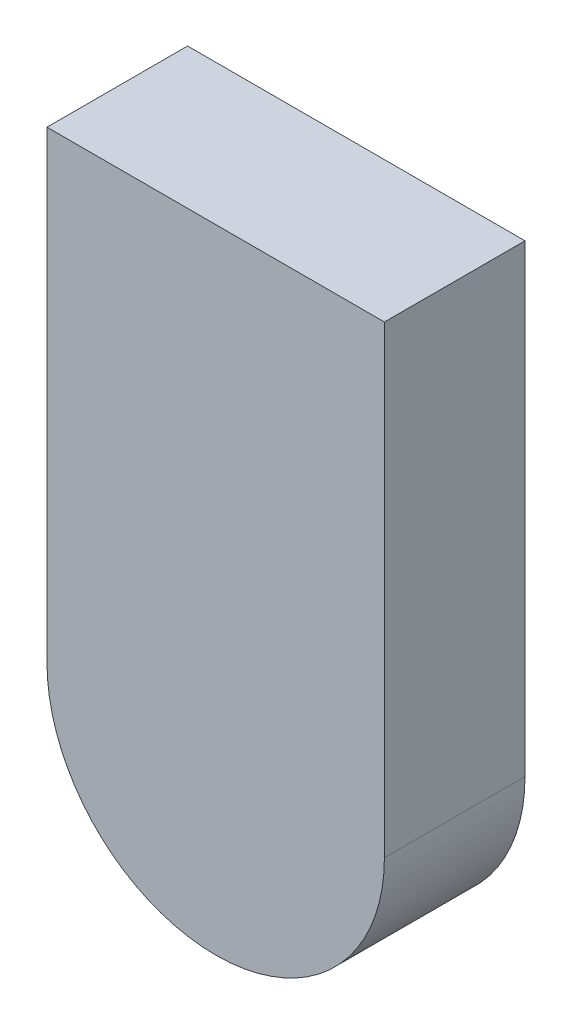
ISO-10303-21;
HEADER;
FILE_DESCRIPTION(('STEP AP214'),'2;1');
FILE_NAME('part.step','',(''),(''),'','','');
FILE_SCHEMA(('AUTOMOTIVE_DESIGN { 1 0 10303 214 1 1 1 1 }'));
ENDSEC;
DATA;
#1=APPLICATION_CONTEXT('core data for automotive mechanical design processes');
#2=APPLICATION_PROTOCOL_DEFINITION('international standard','automotive_design',2000,#1);
#3=PRODUCT_CONTEXT('',#1,'mechanical');
#4=PRODUCT('Part','Part','',(#3));
#5=PRODUCT_RELATED_PRODUCT_CATEGORY('part','',(#4));
#6=PRODUCT_DEFINITION_FORMATION('','',#4);
#7=PRODUCT_DEFINITION_CONTEXT('part definition',#1,'design');
#8=PRODUCT_DEFINITION('design','',#6,#7);
#9=PRODUCT_DEFINITION_SHAPE('','',#8);
#10=(LENGTH_UNIT() NAMED_UNIT(*) SI_UNIT(.MILLI.,.METRE.));
#11=(NAMED_UNIT(*) PLANE_ANGLE_UNIT() SI_UNIT($,.RADIAN.));
#12=(NAMED_UNIT(*) SI_UNIT($,.STERADIAN.) SOLID_ANGLE_UNIT());
#13=UNCERTAINTY_MEASURE_WITH_UNIT(LENGTH_MEASURE(1.E-05),#10,'distance_accuracy_value','');
#14=(GEOMETRIC_REPRESENTATION_CONTEXT(3) GLOBAL_UNCERTAINTY_ASSIGNED_CONTEXT((#13)) GLOBAL_UNIT_ASSIGNED_CONTEXT((#10,
#11,#12)) REPRESENTATION_CONTEXT('',''));
#15=CARTESIAN_POINT('',(0.,0.,0.));
#16=DIRECTION('',(0.,0.,1.));
#17=DIRECTION('',(1.,0.,0.));
#18=AXIS2_PLACEMENT_3D('',#15,#16,#17);
#19=CARTESIAN_POINT('',(-3.37,4.05,0.));
#20=DIRECTION('',(0.,1.,0.));
#21=DIRECTION('',(1.,0.,0.));
#22=AXIS2_PLACEMENT_3D('',#19,#20,#21);
#23=PLANE('',#22);
#24=DIRECTION('',(0.,0.,1.));
#25=VECTOR('',#24,1.);
#26=CARTESIAN_POINT('',(-3.37,4.05,0.));
#27=LINE('',#26,#25);
#28=CARTESIAN_POINT('',(-3.37,4.05,0.));
#29=VERTEX_POINT('',#28);
#30=CARTESIAN_POINT('',(-3.37,4.05,0.1));
#31=VERTEX_POINT('',#30);
#32=EDGE_CURVE('E11',#29,#31,#27,.T.);
#33=ORIENTED_EDGE('',*,*,#32,.T.);
#34=DIRECTION('',(1.,0.,0.));
#35=VECTOR('',#34,1.);
#36=CARTESIAN_POINT('',(-3.37,4.05,0.1));
#37=LINE('',#36,#35);
#38=CARTESIAN_POINT('',(-3.13,4.05,0.1));
#39=VERTEX_POINT('',#38);
#40=EDGE_CURVE('E24',#31,#39,#37,.T.);
#41=ORIENTED_EDGE('',*,*,#40,.T.);
#42=DIRECTION('',(0.,0.,1.));
#43=VECTOR('',#42,1.);
#44=CARTESIAN_POINT('',(-3.13,4.05,0.));
#45=LINE('',#44,#43);
#46=CARTESIAN_POINT('',(-3.13,4.05,0.));
#47=VERTEX_POINT('',#46);
#48=EDGE_CURVE('E85',#47,#39,#45,.T.);
#49=ORIENTED_EDGE('',*,*,#48,.F.);
#50=DIRECTION('',(1.,0.,0.));
#51=VECTOR('',#50,1.);
#52=CARTESIAN_POINT('',(-3.37,4.05,0.));
#53=LINE('',#52,#51);
#54=EDGE_CURVE('E82',#29,#47,#53,.T.);
#55=ORIENTED_EDGE('',*,*,#54,.F.);
#56=EDGE_LOOP('',(#33,#41,#49,#55));
#57=FACE_BOUND('',#56,.T.);
#58=ADVANCED_FACE('F17',(#57),#23,.T.);
#59=CARTESIAN_POINT('',(-3.13,4.05,0.));
#60=DIRECTION('',(1.,0.,0.));
#61=DIRECTION('',(0.,-1.,0.));
#62=AXIS2_PLACEMENT_3D('',#59,#60,#61);
#63=PLANE('',#62);
#64=ORIENTED_EDGE('',*,*,#48,.T.);
#65=DIRECTION('',(0.,-1.,0.));
#66=VECTOR('',#65,1.);
#67=CARTESIAN_POINT('',(-3.13,4.05,0.1));
#68=LINE('',#67,#66);
#69=CARTESIAN_POINT('',(-3.13,3.72,0.1));
#70=VERTEX_POINT('',#69);
#71=EDGE_CURVE('E80',#39,#70,#68,.T.);
#72=ORIENTED_EDGE('',*,*,#71,.T.);
#73=DIRECTION('',(0.,0.,1.));
#74=VECTOR('',#73,1.);
#75=CARTESIAN_POINT('',(-3.13,3.72,0.));
#76=LINE('',#75,#74);
#77=CARTESIAN_POINT('',(-3.13,3.72,0.));
#78=VERTEX_POINT('',#77);
#79=EDGE_CURVE('E60',#78,#70,#76,.T.);
#80=ORIENTED_EDGE('',*,*,#79,.F.);
#81=DIRECTION('',(0.,-1.,0.));
#82=VECTOR('',#81,1.);
#83=CARTESIAN_POINT('',(-3.13,4.05,0.));
#84=LINE('',#83,#82);
#85=EDGE_CURVE('E76',#47,#78,#84,.T.);
#86=ORIENTED_EDGE('',*,*,#85,.F.);
#87=EDGE_LOOP('',(#64,#72,#80,#86));
#88=FACE_BOUND('',#87,.T.);
#89=ADVANCED_FACE('F89',(#88),#63,.T.);
#90=CARTESIAN_POINT('',(-3.25,3.72,0.));
#91=DIRECTION('',(0.,0.,-1.));
#92=DIRECTION('',(1.,0.,0.));
#93=AXIS2_PLACEMENT_3D('',#90,#91,#92);
#94=CYLINDRICAL_SURFACE('',#93,0.12);
#95=CARTESIAN_POINT('',(-3.25,3.72,0.));
#96=DIRECTION('',(0.,0.,1.));
#97=DIRECTION('',(1.,0.,0.));
#98=AXIS2_PLACEMENT_3D('',#95,#96,#97);
#99=CIRCLE('',#98,0.12);
#100=CARTESIAN_POINT('',(-3.37,3.72,0.));
#101=VERTEX_POINT('',#100);
#102=EDGE_CURVE('E64',#101,#78,#99,.T.);
#103=ORIENTED_EDGE('',*,*,#102,.T.);
#104=ORIENTED_EDGE('',*,*,#79,.T.);
#105=CARTESIAN_POINT('',(-3.25,3.72,0.1));
#106=DIRECTION('',(0.,0.,1.));
#107=DIRECTION('',(1.,0.,0.));
#108=AXIS2_PLACEMENT_3D('',#105,#106,#107);
#109=CIRCLE('',#108,0.12);
#110=CARTESIAN_POINT('',(-3.37,3.72,0.1));
#111=VERTEX_POINT('',#110);
#112=EDGE_CURVE('E55',#111,#70,#109,.T.);
#113=ORIENTED_EDGE('',*,*,#112,.F.);
#114=DIRECTION('',(0.,0.,1.));
#115=VECTOR('',#114,1.);
#116=CARTESIAN_POINT('',(-3.37,3.72,0.));
#117=LINE('',#116,#115);
#118=EDGE_CURVE('E59',#101,#111,#117,.T.);
#119=ORIENTED_EDGE('',*,*,#118,.F.);
#120=EDGE_LOOP('',(#103,#104,#113,#119));
#121=FACE_BOUND('',#120,.T.);
#122=ADVANCED_FACE('F58',(#121),#94,.T.);
#123=CARTESIAN_POINT('',(-3.37,4.05,0.));
#124=DIRECTION('',(1.,0.,0.));
#125=DIRECTION('',(0.,-1.,0.));
#126=AXIS2_PLACEMENT_3D('',#123,#124,#125);
#127=PLANE('',#126);
#128=DIRECTION('',(0.,-1.,0.));
#129=VECTOR('',#128,1.);
#130=CARTESIAN_POINT('',(-3.37,4.05,0.));
#131=LINE('',#130,#129);
#132=EDGE_CURVE('E69',#29,#101,#131,.T.);
#133=ORIENTED_EDGE('',*,*,#132,.T.);
#134=ORIENTED_EDGE('',*,*,#118,.T.);
#135=DIRECTION('',(0.,-1.,0.));
#136=VECTOR('',#135,1.);
#137=CARTESIAN_POINT('',(-3.37,4.05,0.1));
#138=LINE('',#137,#136);
#139=EDGE_CURVE('E67',#31,#111,#138,.T.);
#140=ORIENTED_EDGE('',*,*,#139,.F.);
#141=ORIENTED_EDGE('',*,*,#32,.F.);
#142=EDGE_LOOP('',(#133,#134,#140,#141));
#143=FACE_BOUND('',#142,.T.);
#144=ADVANCED_FACE('F66',(#143),#127,.F.);
#145=CARTESIAN_POINT('',(-3.25,3.849490847913,0.));
#146=DIRECTION('',(0.,0.,-1.));
#147=DIRECTION('',(-1.,0.,0.));
#148=AXIS2_PLACEMENT_3D('',#145,#146,#147);
#149=PLANE('',#148);
#150=ORIENTED_EDGE('',*,*,#54,.T.);
#151=ORIENTED_EDGE('',*,*,#85,.T.);
#152=ORIENTED_EDGE('',*,*,#102,.F.);
#153=ORIENTED_EDGE('',*,*,#132,.F.);
#154=EDGE_LOOP('',(#150,#151,#152,#153));
#155=FACE_BOUND('',#154,.T.);
#156=ADVANCED_FACE('F91',(#155),#149,.T.);
#157=CARTESIAN_POINT('',(-3.25,3.849490847913,0.1));
#158=DIRECTION('',(0.,0.,-1.));
#159=DIRECTION('',(-1.,0.,0.));
#160=AXIS2_PLACEMENT_3D('',#157,#158,#159);
#161=PLANE('',#160);
#162=ORIENTED_EDGE('',*,*,#139,.T.);
#163=ORIENTED_EDGE('',*,*,#112,.T.);
#164=ORIENTED_EDGE('',*,*,#71,.F.);
#165=ORIENTED_EDGE('',*,*,#40,.F.);
#166=EDGE_LOOP('',(#162,#163,#164,#165));
#167=FACE_BOUND('',#166,.T.);
#168=ADVANCED_FACE('F71',(#167),#161,.F.);
#169=CLOSED_SHELL('',(#58,#89,#122,#144,#156,#168));
#170=MANIFOLD_SOLID_BREP('B1',#169);
#171=ADVANCED_BREP_SHAPE_REPRESENTATION('',(#18,#170),#14);
#172=SHAPE_DEFINITION_REPRESENTATION(#9,#171);
ENDSEC;
END-ISO-10303-21;
